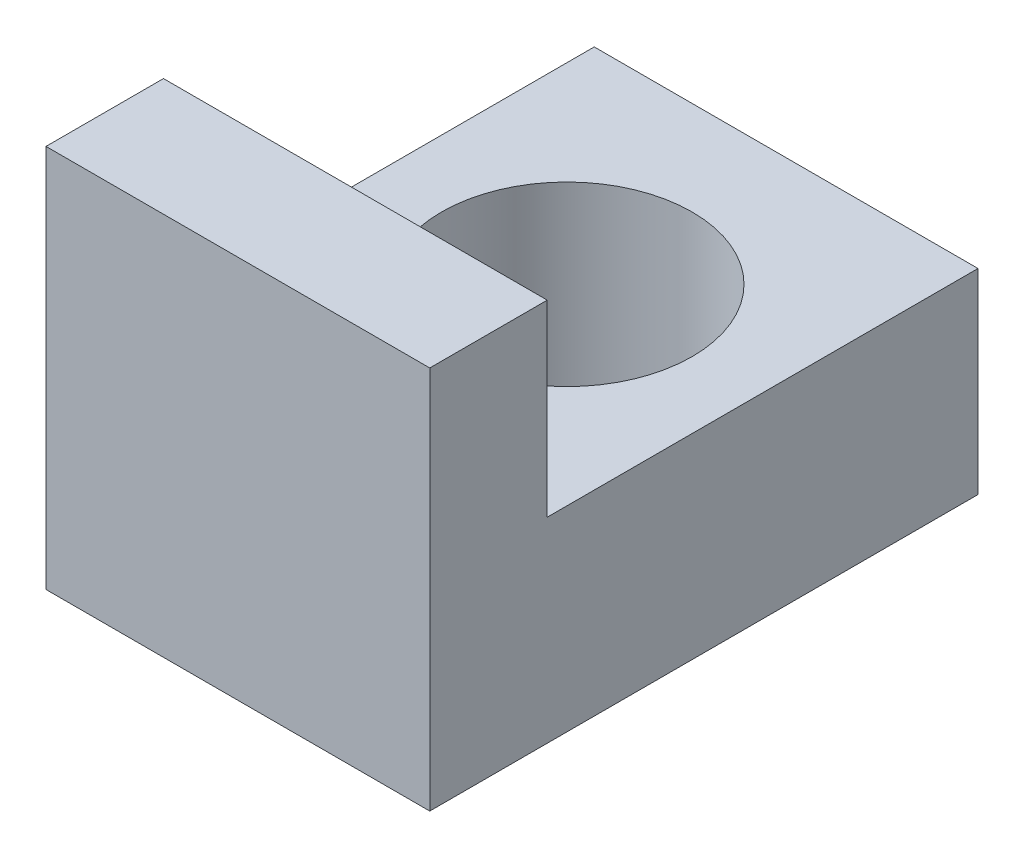
ISO-10303-21;
HEADER;
FILE_DESCRIPTION(('STEP AP214'),'2;1');
FILE_NAME('part.step','',(''),(''),'','','');
FILE_SCHEMA(('AUTOMOTIVE_DESIGN { 1 0 10303 214 1 1 1 1 }'));
ENDSEC;
DATA;
#1=APPLICATION_CONTEXT('core data for automotive mechanical design processes');
#2=APPLICATION_PROTOCOL_DEFINITION('international standard','automotive_design',2000,#1);
#3=PRODUCT_CONTEXT('',#1,'mechanical');
#4=PRODUCT('Part','Part','',(#3));
#5=PRODUCT_RELATED_PRODUCT_CATEGORY('part','',(#4));
#6=PRODUCT_DEFINITION_FORMATION('','',#4);
#7=PRODUCT_DEFINITION_CONTEXT('part definition',#1,'design');
#8=PRODUCT_DEFINITION('design','',#6,#7);
#9=PRODUCT_DEFINITION_SHAPE('','',#8);
#10=(LENGTH_UNIT() NAMED_UNIT(*) SI_UNIT(.MILLI.,.METRE.));
#11=(NAMED_UNIT(*) PLANE_ANGLE_UNIT() SI_UNIT($,.RADIAN.));
#12=(NAMED_UNIT(*) SI_UNIT($,.STERADIAN.) SOLID_ANGLE_UNIT());
#13=UNCERTAINTY_MEASURE_WITH_UNIT(LENGTH_MEASURE(1.E-05),#10,'distance_accuracy_value','');
#14=(GEOMETRIC_REPRESENTATION_CONTEXT(3) GLOBAL_UNCERTAINTY_ASSIGNED_CONTEXT((#13)) GLOBAL_UNIT_ASSIGNED_CONTEXT((#10,
#11,#12)) REPRESENTATION_CONTEXT('',''));
#15=CARTESIAN_POINT('',(0.,0.,0.));
#16=DIRECTION('',(0.,0.,1.));
#17=DIRECTION('',(1.,0.,0.));
#18=AXIS2_PLACEMENT_3D('',#15,#16,#17);
#19=CARTESIAN_POINT('',(4.9,0.,-7.));
#20=DIRECTION('',(0.,1.,0.));
#21=DIRECTION('',(0.,0.,1.));
#22=AXIS2_PLACEMENT_3D('',#19,#20,#21);
#23=PLANE('',#22);
#24=CARTESIAN_POINT('',(2.45,0.,-4.2));
#25=DIRECTION('',(0.,-1.,0.));
#26=DIRECTION('',(0.,0.,-1.));
#27=AXIS2_PLACEMENT_3D('',#24,#25,#26);
#28=CIRCLE('',#27,1.6);
#29=CARTESIAN_POINT('',(2.45,0.,-5.8));
#30=VERTEX_POINT('',#29);
#31=EDGE_CURVE('E162',#30,#30,#28,.T.);
#32=ORIENTED_EDGE('',*,*,#31,.F.);
#33=EDGE_LOOP('',(#32));
#34=FACE_BOUND('',#33,.T.);
#35=DIRECTION('',(0.,0.,-1.));
#36=VECTOR('',#35,1.);
#37=CARTESIAN_POINT('',(0.,0.,-7.));
#38=LINE('',#37,#36);
#39=CARTESIAN_POINT('',(0.,0.,0.));
#40=VERTEX_POINT('',#39);
#41=CARTESIAN_POINT('',(0.,0.,-7.));
#42=VERTEX_POINT('',#41);
#43=EDGE_CURVE('E120',#40,#42,#38,.T.);
#44=ORIENTED_EDGE('',*,*,#43,.T.);
#45=DIRECTION('',(-1.,0.,0.));
#46=VECTOR('',#45,1.);
#47=CARTESIAN_POINT('',(4.9,0.,-7.));
#48=LINE('',#47,#46);
#49=CARTESIAN_POINT('',(4.9,0.,-7.));
#50=VERTEX_POINT('',#49);
#51=EDGE_CURVE('E11',#50,#42,#48,.T.);
#52=ORIENTED_EDGE('',*,*,#51,.F.);
#53=DIRECTION('',(0.,0.,-1.));
#54=VECTOR('',#53,1.);
#55=CARTESIAN_POINT('',(4.9,0.,-7.));
#56=LINE('',#55,#54);
#57=CARTESIAN_POINT('',(4.9,0.,0.));
#58=VERTEX_POINT('',#57);
#59=EDGE_CURVE('E130',#58,#50,#56,.T.);
#60=ORIENTED_EDGE('',*,*,#59,.F.);
#61=DIRECTION('',(-1.,0.,0.));
#62=VECTOR('',#61,1.);
#63=CARTESIAN_POINT('',(4.9,0.,0.));
#64=LINE('',#63,#62);
#65=EDGE_CURVE('E116',#58,#40,#64,.T.);
#66=ORIENTED_EDGE('',*,*,#65,.T.);
#67=EDGE_LOOP('',(#44,#52,#60,#66));
#68=FACE_BOUND('',#67,.T.);
#69=ADVANCED_FACE('F35',(#34,#68),#23,.F.);
#70=CARTESIAN_POINT('',(4.9,2.5,-7.));
#71=DIRECTION('',(0.,0.,1.));
#72=DIRECTION('',(1.,0.,0.));
#73=AXIS2_PLACEMENT_3D('',#70,#71,#72);
#74=PLANE('',#73);
#75=DIRECTION('',(0.,1.,0.));
#76=VECTOR('',#75,1.);
#77=CARTESIAN_POINT('',(0.,2.5,-7.));
#78=LINE('',#77,#76);
#79=CARTESIAN_POINT('',(0.,2.5,-7.));
#80=VERTEX_POINT('',#79);
#81=EDGE_CURVE('E123',#42,#80,#78,.T.);
#82=ORIENTED_EDGE('',*,*,#81,.T.);
#83=DIRECTION('',(-1.,0.,0.));
#84=VECTOR('',#83,1.);
#85=CARTESIAN_POINT('',(4.9,2.5,-7.));
#86=LINE('',#85,#84);
#87=CARTESIAN_POINT('',(4.9,2.5,-7.));
#88=VERTEX_POINT('',#87);
#89=EDGE_CURVE('E44',#88,#80,#86,.T.);
#90=ORIENTED_EDGE('',*,*,#89,.F.);
#91=DIRECTION('',(0.,1.,0.));
#92=VECTOR('',#91,1.);
#93=CARTESIAN_POINT('',(4.9,2.5,-7.));
#94=LINE('',#93,#92);
#95=EDGE_CURVE('E89',#50,#88,#94,.T.);
#96=ORIENTED_EDGE('',*,*,#95,.F.);
#97=ORIENTED_EDGE('',*,*,#51,.T.);
#98=EDGE_LOOP('',(#82,#90,#96,#97));
#99=FACE_BOUND('',#98,.T.);
#100=ADVANCED_FACE('F155',(#99),#74,.F.);
#101=CARTESIAN_POINT('',(4.9,2.5,-1.5));
#102=DIRECTION('',(0.,-1.,0.));
#103=DIRECTION('',(0.,0.,-1.));
#104=AXIS2_PLACEMENT_3D('',#101,#102,#103);
#105=PLANE('',#104);
#106=CARTESIAN_POINT('',(2.45,2.5,-4.2));
#107=DIRECTION('',(0.,-1.,0.));
#108=DIRECTION('',(0.,0.,-1.));
#109=AXIS2_PLACEMENT_3D('',#106,#107,#108);
#110=CIRCLE('',#109,1.6);
#111=CARTESIAN_POINT('',(2.45,2.5,-5.8));
#112=VERTEX_POINT('',#111);
#113=EDGE_CURVE('E38',#112,#112,#110,.T.);
#114=ORIENTED_EDGE('',*,*,#113,.T.);
#115=EDGE_LOOP('',(#114));
#116=FACE_BOUND('',#115,.T.);
#117=DIRECTION('',(0.,0.,1.));
#118=VECTOR('',#117,1.);
#119=CARTESIAN_POINT('',(0.,2.5,-1.5));
#120=LINE('',#119,#118);
#121=CARTESIAN_POINT('',(0.,2.5,-1.5));
#122=VERTEX_POINT('',#121);
#123=EDGE_CURVE('E125',#80,#122,#120,.T.);
#124=ORIENTED_EDGE('',*,*,#123,.T.);
#125=DIRECTION('',(-1.,0.,0.));
#126=VECTOR('',#125,1.);
#127=CARTESIAN_POINT('',(4.9,2.5,-1.5));
#128=LINE('',#127,#126);
#129=CARTESIAN_POINT('',(4.9,2.5,-1.5));
#130=VERTEX_POINT('',#129);
#131=EDGE_CURVE('E111',#130,#122,#128,.T.);
#132=ORIENTED_EDGE('',*,*,#131,.F.);
#133=DIRECTION('',(0.,0.,1.));
#134=VECTOR('',#133,1.);
#135=CARTESIAN_POINT('',(4.9,2.5,-1.5));
#136=LINE('',#135,#134);
#137=EDGE_CURVE('E102',#88,#130,#136,.T.);
#138=ORIENTED_EDGE('',*,*,#137,.F.);
#139=ORIENTED_EDGE('',*,*,#89,.T.);
#140=EDGE_LOOP('',(#124,#132,#138,#139));
#141=FACE_BOUND('',#140,.T.);
#142=ADVANCED_FACE('F137',(#116,#141),#105,.F.);
#143=CARTESIAN_POINT('',(4.9,4.9,-1.5));
#144=DIRECTION('',(0.,0.,1.));
#145=DIRECTION('',(0.,-1.,0.));
#146=AXIS2_PLACEMENT_3D('',#143,#144,#145);
#147=PLANE('',#146);
#148=DIRECTION('',(0.,1.,0.));
#149=VECTOR('',#148,1.);
#150=CARTESIAN_POINT('',(0.,4.9,-1.5));
#151=LINE('',#150,#149);
#152=CARTESIAN_POINT('',(0.,4.9,-1.5));
#153=VERTEX_POINT('',#152);
#154=EDGE_CURVE('E110',#122,#153,#151,.T.);
#155=ORIENTED_EDGE('',*,*,#154,.T.);
#156=DIRECTION('',(-1.,0.,0.));
#157=VECTOR('',#156,1.);
#158=CARTESIAN_POINT('',(4.9,4.9,-1.5));
#159=LINE('',#158,#157);
#160=CARTESIAN_POINT('',(4.9,4.9,-1.5));
#161=VERTEX_POINT('',#160);
#162=EDGE_CURVE('E107',#161,#153,#159,.T.);
#163=ORIENTED_EDGE('',*,*,#162,.F.);
#164=DIRECTION('',(0.,1.,0.));
#165=VECTOR('',#164,1.);
#166=CARTESIAN_POINT('',(4.9,4.9,-1.5));
#167=LINE('',#166,#165);
#168=EDGE_CURVE('E96',#130,#161,#167,.T.);
#169=ORIENTED_EDGE('',*,*,#168,.F.);
#170=ORIENTED_EDGE('',*,*,#131,.T.);
#171=EDGE_LOOP('',(#155,#163,#169,#170));
#172=FACE_BOUND('',#171,.T.);
#173=ADVANCED_FACE('F108',(#172),#147,.F.);
#174=CARTESIAN_POINT('',(4.9,4.9,0.));
#175=DIRECTION('',(0.,-1.,0.));
#176=DIRECTION('',(0.,0.,-1.));
#177=AXIS2_PLACEMENT_3D('',#174,#175,#176);
#178=PLANE('',#177);
#179=DIRECTION('',(0.,0.,1.));
#180=VECTOR('',#179,1.);
#181=CARTESIAN_POINT('',(0.,4.9,0.));
#182=LINE('',#181,#180);
#183=CARTESIAN_POINT('',(0.,4.9,0.));
#184=VERTEX_POINT('',#183);
#185=EDGE_CURVE('E75',#153,#184,#182,.T.);
#186=ORIENTED_EDGE('',*,*,#185,.T.);
#187=DIRECTION('',(-1.,0.,0.));
#188=VECTOR('',#187,1.);
#189=CARTESIAN_POINT('',(4.9,4.9,0.));
#190=LINE('',#189,#188);
#191=CARTESIAN_POINT('',(4.9,4.9,0.));
#192=VERTEX_POINT('',#191);
#193=EDGE_CURVE('E112',#192,#184,#190,.T.);
#194=ORIENTED_EDGE('',*,*,#193,.F.);
#195=DIRECTION('',(0.,0.,1.));
#196=VECTOR('',#195,1.);
#197=CARTESIAN_POINT('',(4.9,4.9,0.));
#198=LINE('',#197,#196);
#199=EDGE_CURVE('E100',#161,#192,#198,.T.);
#200=ORIENTED_EDGE('',*,*,#199,.F.);
#201=ORIENTED_EDGE('',*,*,#162,.T.);
#202=EDGE_LOOP('',(#186,#194,#200,#201));
#203=FACE_BOUND('',#202,.T.);
#204=ADVANCED_FACE('F114',(#203),#178,.F.);
#205=CARTESIAN_POINT('',(4.9,0.,0.));
#206=DIRECTION('',(0.,0.,-1.));
#207=DIRECTION('',(-1.,0.,0.));
#208=AXIS2_PLACEMENT_3D('',#205,#206,#207);
#209=PLANE('',#208);
#210=DIRECTION('',(0.,-1.,0.));
#211=VECTOR('',#210,1.);
#212=CARTESIAN_POINT('',(0.,0.,0.));
#213=LINE('',#212,#211);
#214=EDGE_CURVE('E81',#184,#40,#213,.T.);
#215=ORIENTED_EDGE('',*,*,#214,.T.);
#216=ORIENTED_EDGE('',*,*,#65,.F.);
#217=DIRECTION('',(0.,-1.,0.));
#218=VECTOR('',#217,1.);
#219=CARTESIAN_POINT('',(4.9,0.,0.));
#220=LINE('',#219,#218);
#221=EDGE_CURVE('E52',#192,#58,#220,.T.);
#222=ORIENTED_EDGE('',*,*,#221,.F.);
#223=ORIENTED_EDGE('',*,*,#193,.T.);
#224=EDGE_LOOP('',(#215,#216,#222,#223));
#225=FACE_BOUND('',#224,.T.);
#226=ADVANCED_FACE('F144',(#225),#209,.F.);
#227=CARTESIAN_POINT('',(4.9,0.,0.));
#228=DIRECTION('',(-1.,0.,0.));
#229=DIRECTION('',(0.,0.,1.));
#230=AXIS2_PLACEMENT_3D('',#227,#228,#229);
#231=PLANE('',#230);
#232=ORIENTED_EDGE('',*,*,#59,.T.);
#233=ORIENTED_EDGE('',*,*,#95,.T.);
#234=ORIENTED_EDGE('',*,*,#137,.T.);
#235=ORIENTED_EDGE('',*,*,#168,.T.);
#236=ORIENTED_EDGE('',*,*,#199,.T.);
#237=ORIENTED_EDGE('',*,*,#221,.T.);
#238=EDGE_LOOP('',(#232,#233,#234,#235,#236,#237));
#239=FACE_BOUND('',#238,.T.);
#240=ADVANCED_FACE('F98',(#239),#231,.F.);
#241=CARTESIAN_POINT('',(0.,0.,0.));
#242=DIRECTION('',(-1.,0.,0.));
#243=DIRECTION('',(0.,0.,1.));
#244=AXIS2_PLACEMENT_3D('',#241,#242,#243);
#245=PLANE('',#244);
#246=ORIENTED_EDGE('',*,*,#43,.F.);
#247=ORIENTED_EDGE('',*,*,#214,.F.);
#248=ORIENTED_EDGE('',*,*,#185,.F.);
#249=ORIENTED_EDGE('',*,*,#154,.F.);
#250=ORIENTED_EDGE('',*,*,#123,.F.);
#251=ORIENTED_EDGE('',*,*,#81,.F.);
#252=EDGE_LOOP('',(#246,#247,#248,#249,#250,#251));
#253=FACE_BOUND('',#252,.T.);
#254=ADVANCED_FACE('F140',(#253),#245,.T.);
#255=CARTESIAN_POINT('',(2.45,4.9,-4.2));
#256=DIRECTION('',(0.,-1.,0.));
#257=DIRECTION('',(0.,0.,-1.));
#258=AXIS2_PLACEMENT_3D('',#255,#256,#257);
#259=CYLINDRICAL_SURFACE('',#258,1.6);
#260=ORIENTED_EDGE('',*,*,#31,.T.);
#261=EDGE_LOOP('',(#260));
#262=FACE_BOUND('',#261,.T.);
#263=ORIENTED_EDGE('',*,*,#113,.F.);
#264=EDGE_LOOP('',(#263));
#265=FACE_BOUND('',#264,.T.);
#266=ADVANCED_FACE('F171',(#262,#265),#259,.F.);
#267=CLOSED_SHELL('',(#69,#100,#142,#173,#204,#226,#240,#254,#266));
#268=MANIFOLD_SOLID_BREP('B2',#267);
#269=ADVANCED_BREP_SHAPE_REPRESENTATION('',(#18,#268),#14);
#270=SHAPE_DEFINITION_REPRESENTATION(#9,#269);
ENDSEC;
END-ISO-10303-21;
